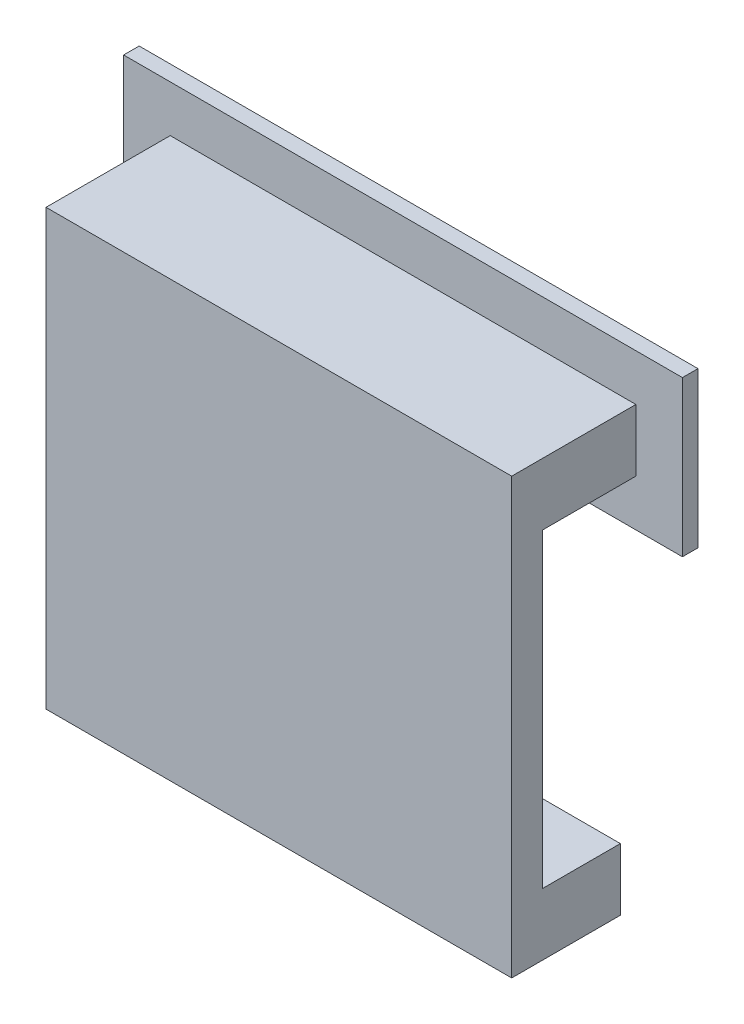
ISO-10303-21;
HEADER;
FILE_DESCRIPTION(('STEP AP214'),'2;1');
FILE_NAME('part.step','',(''),(''),'','','');
FILE_SCHEMA(('AUTOMOTIVE_DESIGN { 1 0 10303 214 1 1 1 1 }'));
ENDSEC;
DATA;
#1=APPLICATION_CONTEXT('core data for automotive mechanical design processes');
#2=APPLICATION_PROTOCOL_DEFINITION('international standard','automotive_design',2000,#1);
#3=PRODUCT_CONTEXT('',#1,'mechanical');
#4=PRODUCT('Part','Part','',(#3));
#5=PRODUCT_RELATED_PRODUCT_CATEGORY('part','',(#4));
#6=PRODUCT_DEFINITION_FORMATION('','',#4);
#7=PRODUCT_DEFINITION_CONTEXT('part definition',#1,'design');
#8=PRODUCT_DEFINITION('design','',#6,#7);
#9=PRODUCT_DEFINITION_SHAPE('','',#8);
#10=(LENGTH_UNIT() NAMED_UNIT(*) SI_UNIT(.MILLI.,.METRE.));
#11=(NAMED_UNIT(*) PLANE_ANGLE_UNIT() SI_UNIT($,.RADIAN.));
#12=(NAMED_UNIT(*) SI_UNIT($,.STERADIAN.) SOLID_ANGLE_UNIT());
#13=UNCERTAINTY_MEASURE_WITH_UNIT(LENGTH_MEASURE(1.E-05),#10,'distance_accuracy_value','');
#14=(GEOMETRIC_REPRESENTATION_CONTEXT(3) GLOBAL_UNCERTAINTY_ASSIGNED_CONTEXT((#13)) GLOBAL_UNIT_ASSIGNED_CONTEXT((#10,
#11,#12)) REPRESENTATION_CONTEXT('',''));
#15=CARTESIAN_POINT('',(0.,0.,0.));
#16=DIRECTION('',(0.,0.,1.));
#17=DIRECTION('',(1.,0.,0.));
#18=AXIS2_PLACEMENT_3D('',#15,#16,#17);
#19=CARTESIAN_POINT('',(0.,0.,0.));
#20=DIRECTION('',(0.,0.,1.));
#21=DIRECTION('',(1.,0.,0.));
#22=AXIS2_PLACEMENT_3D('',#19,#20,#21);
#23=PLANE('',#22);
#24=DIRECTION('',(1.,0.,0.));
#25=VECTOR('',#24,1.);
#26=CARTESIAN_POINT('',(19.05,2.54,0.));
#27=LINE('',#26,#25);
#28=CARTESIAN_POINT('',(-19.05,2.54,0.));
#29=VERTEX_POINT('',#28);
#30=CARTESIAN_POINT('',(19.05,2.54,0.));
#31=VERTEX_POINT('',#30);
#32=EDGE_CURVE('E147',#29,#31,#27,.T.);
#33=ORIENTED_EDGE('',*,*,#32,.F.);
#34=DIRECTION('',(0.,-1.,0.));
#35=VECTOR('',#34,1.);
#36=CARTESIAN_POINT('',(-19.05,2.54,0.));
#37=LINE('',#36,#35);
#38=CARTESIAN_POINT('',(-19.05,27.94,0.));
#39=VERTEX_POINT('',#38);
#40=EDGE_CURVE('E201',#39,#29,#37,.T.);
#41=ORIENTED_EDGE('',*,*,#40,.F.);
#42=DIRECTION('',(-1.,0.,0.));
#43=VECTOR('',#42,1.);
#44=CARTESIAN_POINT('',(19.05,27.94,0.));
#45=LINE('',#44,#43);
#46=CARTESIAN_POINT('',(19.05,27.94,0.));
#47=VERTEX_POINT('',#46);
#48=EDGE_CURVE('E169',#47,#39,#45,.T.);
#49=ORIENTED_EDGE('',*,*,#48,.F.);
#50=DIRECTION('',(0.,1.,0.));
#51=VECTOR('',#50,1.);
#52=CARTESIAN_POINT('',(19.05,2.54,0.));
#53=LINE('',#52,#51);
#54=EDGE_CURVE('E48',#31,#47,#53,.T.);
#55=ORIENTED_EDGE('',*,*,#54,.F.);
#56=EDGE_LOOP('',(#33,#41,#49,#55));
#57=FACE_BOUND('',#56,.T.);
#58=ADVANCED_FACE('F33',(#57),#23,.F.);
#59=CARTESIAN_POINT('',(19.05,2.54,2.54));
#60=DIRECTION('',(-1.,0.,0.));
#61=DIRECTION('',(0.,0.,1.));
#62=AXIS2_PLACEMENT_3D('',#59,#60,#61);
#63=PLANE('',#62);
#64=DIRECTION('',(0.,0.,-1.));
#65=VECTOR('',#64,1.);
#66=CARTESIAN_POINT('',(19.05,-2.54,2.54));
#67=LINE('',#66,#65);
#68=CARTESIAN_POINT('',(19.05,-2.54,2.54));
#69=VERTEX_POINT('',#68);
#70=CARTESIAN_POINT('',(19.05,-2.54,-6.35));
#71=VERTEX_POINT('',#70);
#72=EDGE_CURVE('E41',#69,#71,#67,.T.);
#73=ORIENTED_EDGE('',*,*,#72,.T.);
#74=DIRECTION('',(0.,-1.,0.));
#75=VECTOR('',#74,1.);
#76=CARTESIAN_POINT('',(19.05,2.54,-6.35));
#77=LINE('',#76,#75);
#78=CARTESIAN_POINT('',(19.05,2.54,-6.35));
#79=VERTEX_POINT('',#78);
#80=EDGE_CURVE('E159',#79,#71,#77,.T.);
#81=ORIENTED_EDGE('',*,*,#80,.F.);
#82=DIRECTION('',(0.,0.,1.));
#83=VECTOR('',#82,1.);
#84=CARTESIAN_POINT('',(19.05,2.54,-6.35));
#85=LINE('',#84,#83);
#86=EDGE_CURVE('E164',#79,#31,#85,.T.);
#87=ORIENTED_EDGE('',*,*,#86,.T.);
#88=ORIENTED_EDGE('',*,*,#54,.T.);
#89=DIRECTION('',(0.,0.,1.));
#90=VECTOR('',#89,1.);
#91=CARTESIAN_POINT('',(19.05,27.94,-7.62));
#92=LINE('',#91,#90);
#93=CARTESIAN_POINT('',(19.05,27.94,-7.62));
#94=VERTEX_POINT('',#93);
#95=EDGE_CURVE('E187',#94,#47,#92,.T.);
#96=ORIENTED_EDGE('',*,*,#95,.F.);
#97=DIRECTION('',(0.,-1.,0.));
#98=VECTOR('',#97,1.);
#99=CARTESIAN_POINT('',(19.05,27.94,-7.62));
#100=LINE('',#99,#98);
#101=CARTESIAN_POINT('',(19.05,33.02,-7.62));
#102=VERTEX_POINT('',#101);
#103=EDGE_CURVE('E176',#102,#94,#100,.T.);
#104=ORIENTED_EDGE('',*,*,#103,.F.);
#105=DIRECTION('',(0.,0.,-1.));
#106=VECTOR('',#105,1.);
#107=CARTESIAN_POINT('',(19.05,33.02,0.));
#108=LINE('',#107,#106);
#109=CARTESIAN_POINT('',(19.05,33.02,2.54));
#110=VERTEX_POINT('',#109);
#111=EDGE_CURVE('E190',#110,#102,#108,.T.);
#112=ORIENTED_EDGE('',*,*,#111,.F.);
#113=DIRECTION('',(0.,1.,0.));
#114=VECTOR('',#113,1.);
#115=CARTESIAN_POINT('',(19.05,2.54,2.54));
#116=LINE('',#115,#114);
#117=EDGE_CURVE('E198',#69,#110,#116,.T.);
#118=ORIENTED_EDGE('',*,*,#117,.F.);
#119=EDGE_LOOP('',(#73,#81,#87,#88,#96,#104,#112,#118));
#120=FACE_BOUND('',#119,.T.);
#121=ADVANCED_FACE('F35',(#120),#63,.F.);
#122=CARTESIAN_POINT('',(-19.05,2.54,2.54));
#123=DIRECTION('',(1.,0.,0.));
#124=DIRECTION('',(0.,0.,-1.));
#125=AXIS2_PLACEMENT_3D('',#122,#123,#124);
#126=PLANE('',#125);
#127=DIRECTION('',(0.,0.,1.));
#128=VECTOR('',#127,1.);
#129=CARTESIAN_POINT('',(-19.05,33.02,0.));
#130=LINE('',#129,#128);
#131=CARTESIAN_POINT('',(-19.05,33.02,-7.62));
#132=VERTEX_POINT('',#131);
#133=CARTESIAN_POINT('',(-19.05,33.02,2.54));
#134=VERTEX_POINT('',#133);
#135=EDGE_CURVE('E192',#132,#134,#130,.T.);
#136=ORIENTED_EDGE('',*,*,#135,.F.);
#137=DIRECTION('',(0.,1.,0.));
#138=VECTOR('',#137,1.);
#139=CARTESIAN_POINT('',(-19.05,27.94,-7.62));
#140=LINE('',#139,#138);
#141=CARTESIAN_POINT('',(-19.05,27.94,-7.62));
#142=VERTEX_POINT('',#141);
#143=EDGE_CURVE('E170',#142,#132,#140,.T.);
#144=ORIENTED_EDGE('',*,*,#143,.F.);
#145=DIRECTION('',(0.,0.,1.));
#146=VECTOR('',#145,1.);
#147=CARTESIAN_POINT('',(-19.05,27.94,-7.62));
#148=LINE('',#147,#146);
#149=EDGE_CURVE('E182',#142,#39,#148,.T.);
#150=ORIENTED_EDGE('',*,*,#149,.T.);
#151=ORIENTED_EDGE('',*,*,#40,.T.);
#152=DIRECTION('',(0.,0.,1.));
#153=VECTOR('',#152,1.);
#154=CARTESIAN_POINT('',(-19.05,2.54,-6.35));
#155=LINE('',#154,#153);
#156=CARTESIAN_POINT('',(-19.05,2.54,-6.35));
#157=VERTEX_POINT('',#156);
#158=EDGE_CURVE('E167',#157,#29,#155,.T.);
#159=ORIENTED_EDGE('',*,*,#158,.F.);
#160=DIRECTION('',(0.,1.,0.));
#161=VECTOR('',#160,1.);
#162=CARTESIAN_POINT('',(-19.05,2.54,-6.35));
#163=LINE('',#162,#161);
#164=CARTESIAN_POINT('',(-19.05,-2.54,-6.35));
#165=VERTEX_POINT('',#164);
#166=EDGE_CURVE('E149',#165,#157,#163,.T.);
#167=ORIENTED_EDGE('',*,*,#166,.F.);
#168=DIRECTION('',(0.,0.,-1.));
#169=VECTOR('',#168,1.);
#170=CARTESIAN_POINT('',(-19.05,-2.54,2.54));
#171=LINE('',#170,#169);
#172=CARTESIAN_POINT('',(-19.05,-2.54,2.54));
#173=VERTEX_POINT('',#172);
#174=EDGE_CURVE('E11',#173,#165,#171,.T.);
#175=ORIENTED_EDGE('',*,*,#174,.F.);
#176=DIRECTION('',(0.,-1.,0.));
#177=VECTOR('',#176,1.);
#178=CARTESIAN_POINT('',(-19.05,2.54,2.54));
#179=LINE('',#178,#177);
#180=EDGE_CURVE('E200',#134,#173,#179,.T.);
#181=ORIENTED_EDGE('',*,*,#180,.F.);
#182=EDGE_LOOP('',(#136,#144,#150,#151,#159,#167,#175,#181));
#183=FACE_BOUND('',#182,.T.);
#184=ADVANCED_FACE('F218',(#183),#126,.F.);
#185=CARTESIAN_POINT('',(-19.05,-2.54,2.54));
#186=DIRECTION('',(0.,1.,0.));
#187=DIRECTION('',(0.,0.,1.));
#188=AXIS2_PLACEMENT_3D('',#185,#186,#187);
#189=PLANE('',#188);
#190=ORIENTED_EDGE('',*,*,#174,.T.);
#191=DIRECTION('',(-1.,0.,0.));
#192=VECTOR('',#191,1.);
#193=CARTESIAN_POINT('',(19.05,-2.54,-6.35));
#194=LINE('',#193,#192);
#195=EDGE_CURVE('E162',#71,#165,#194,.T.);
#196=ORIENTED_EDGE('',*,*,#195,.F.);
#197=ORIENTED_EDGE('',*,*,#72,.F.);
#198=DIRECTION('',(1.,0.,0.));
#199=VECTOR('',#198,1.);
#200=CARTESIAN_POINT('',(-19.05,-2.54,2.54));
#201=LINE('',#200,#199);
#202=EDGE_CURVE('E56',#173,#69,#201,.T.);
#203=ORIENTED_EDGE('',*,*,#202,.F.);
#204=EDGE_LOOP('',(#190,#196,#197,#203));
#205=FACE_BOUND('',#204,.T.);
#206=ADVANCED_FACE('F215',(#205),#189,.F.);
#207=CARTESIAN_POINT('',(0.,0.,2.54));
#208=DIRECTION('',(0.,0.,1.));
#209=DIRECTION('',(1.,0.,0.));
#210=AXIS2_PLACEMENT_3D('',#207,#208,#209);
#211=PLANE('',#210);
#212=ORIENTED_EDGE('',*,*,#117,.T.);
#213=DIRECTION('',(1.,0.,0.));
#214=VECTOR('',#213,1.);
#215=CARTESIAN_POINT('',(-19.05,33.02,2.54));
#216=LINE('',#215,#214);
#217=EDGE_CURVE('E195',#134,#110,#216,.T.);
#218=ORIENTED_EDGE('',*,*,#217,.F.);
#219=ORIENTED_EDGE('',*,*,#180,.T.);
#220=ORIENTED_EDGE('',*,*,#202,.T.);
#221=EDGE_LOOP('',(#212,#218,#219,#220));
#222=FACE_BOUND('',#221,.T.);
#223=ADVANCED_FACE('F235',(#222),#211,.T.);
#224=CARTESIAN_POINT('',(0.,33.02,0.));
#225=DIRECTION('',(0.,1.,0.));
#226=DIRECTION('',(0.,0.,1.));
#227=AXIS2_PLACEMENT_3D('',#224,#225,#226);
#228=PLANE('',#227);
#229=ORIENTED_EDGE('',*,*,#111,.T.);
#230=DIRECTION('',(1.,0.,0.));
#231=VECTOR('',#230,1.);
#232=CARTESIAN_POINT('',(19.05,33.02,-7.62));
#233=LINE('',#232,#231);
#234=EDGE_CURVE('E173',#132,#102,#233,.T.);
#235=ORIENTED_EDGE('',*,*,#234,.F.);
#236=ORIENTED_EDGE('',*,*,#135,.T.);
#237=ORIENTED_EDGE('',*,*,#217,.T.);
#238=EDGE_LOOP('',(#229,#235,#236,#237));
#239=FACE_BOUND('',#238,.T.);
#240=ADVANCED_FACE('F233',(#239),#228,.T.);
#241=CARTESIAN_POINT('',(19.05,27.94,-7.62));
#242=DIRECTION('',(0.,1.,0.));
#243=DIRECTION('',(0.,0.,1.));
#244=AXIS2_PLACEMENT_3D('',#241,#242,#243);
#245=PLANE('',#244);
#246=ORIENTED_EDGE('',*,*,#48,.T.);
#247=ORIENTED_EDGE('',*,*,#149,.F.);
#248=DIRECTION('',(-1.,0.,0.));
#249=VECTOR('',#248,1.);
#250=CARTESIAN_POINT('',(19.05,27.94,-7.62));
#251=LINE('',#250,#249);
#252=EDGE_CURVE('E179',#94,#142,#251,.T.);
#253=ORIENTED_EDGE('',*,*,#252,.F.);
#254=ORIENTED_EDGE('',*,*,#95,.T.);
#255=EDGE_LOOP('',(#246,#247,#253,#254));
#256=FACE_BOUND('',#255,.T.);
#257=ADVANCED_FACE('F227',(#256),#245,.F.);
#258=CARTESIAN_POINT('',(19.05,2.54,-6.35));
#259=DIRECTION('',(0.,-1.,0.));
#260=DIRECTION('',(0.,0.,-1.));
#261=AXIS2_PLACEMENT_3D('',#258,#259,#260);
#262=PLANE('',#261);
#263=ORIENTED_EDGE('',*,*,#32,.T.);
#264=ORIENTED_EDGE('',*,*,#86,.F.);
#265=DIRECTION('',(1.,0.,0.));
#266=VECTOR('',#265,1.);
#267=CARTESIAN_POINT('',(19.05,2.54,-6.35));
#268=LINE('',#267,#266);
#269=EDGE_CURVE('E157',#157,#79,#268,.T.);
#270=ORIENTED_EDGE('',*,*,#269,.F.);
#271=ORIENTED_EDGE('',*,*,#158,.T.);
#272=EDGE_LOOP('',(#263,#264,#270,#271));
#273=FACE_BOUND('',#272,.T.);
#274=ADVANCED_FACE('F222',(#273),#262,.F.);
#275=CARTESIAN_POINT('',(0.,0.,-6.35));
#276=DIRECTION('',(0.,0.,-1.));
#277=DIRECTION('',(-1.,0.,0.));
#278=AXIS2_PLACEMENT_3D('',#275,#276,#277);
#279=PLANE('',#278);
#280=ORIENTED_EDGE('',*,*,#166,.T.);
#281=ORIENTED_EDGE('',*,*,#269,.T.);
#282=ORIENTED_EDGE('',*,*,#80,.T.);
#283=ORIENTED_EDGE('',*,*,#195,.T.);
#284=EDGE_LOOP('',(#280,#281,#282,#283));
#285=FACE_BOUND('',#284,.T.);
#286=ADVANCED_FACE('F212',(#285),#279,.T.);
#287=CARTESIAN_POINT('',(0.,0.,-7.62));
#288=DIRECTION('',(0.,0.,-1.));
#289=DIRECTION('',(-1.,0.,0.));
#290=AXIS2_PLACEMENT_3D('',#287,#288,#289);
#291=PLANE('',#290);
#292=DIRECTION('',(0.,1.,0.));
#293=VECTOR('',#292,1.);
#294=CARTESIAN_POINT('',(-22.86,36.83,-7.62));
#295=LINE('',#294,#293);
#296=CARTESIAN_POINT('',(-22.86,24.13,-7.62));
#297=VERTEX_POINT('',#296);
#298=CARTESIAN_POINT('',(-22.86,36.83,-7.62));
#299=VERTEX_POINT('',#298);
#300=EDGE_CURVE('E146',#297,#299,#295,.T.);
#301=ORIENTED_EDGE('',*,*,#300,.F.);
#302=DIRECTION('',(-1.,0.,0.));
#303=VECTOR('',#302,1.);
#304=CARTESIAN_POINT('',(22.86,24.13,-7.62));
#305=LINE('',#304,#303);
#306=CARTESIAN_POINT('',(22.86,24.13,-7.62));
#307=VERTEX_POINT('',#306);
#308=EDGE_CURVE('E142',#307,#297,#305,.T.);
#309=ORIENTED_EDGE('',*,*,#308,.F.);
#310=DIRECTION('',(0.,-1.,0.));
#311=VECTOR('',#310,1.);
#312=CARTESIAN_POINT('',(22.86,36.83,-7.62));
#313=LINE('',#312,#311);
#314=CARTESIAN_POINT('',(22.86,36.83,-7.62));
#315=VERTEX_POINT('',#314);
#316=EDGE_CURVE('E378',#315,#307,#313,.T.);
#317=ORIENTED_EDGE('',*,*,#316,.F.);
#318=DIRECTION('',(1.,0.,0.));
#319=VECTOR('',#318,1.);
#320=CARTESIAN_POINT('',(22.86,36.83,-7.62));
#321=LINE('',#320,#319);
#322=EDGE_CURVE('E381',#299,#315,#321,.T.);
#323=ORIENTED_EDGE('',*,*,#322,.F.);
#324=EDGE_LOOP('',(#301,#309,#317,#323));
#325=FACE_BOUND('',#324,.T.);
#326=ORIENTED_EDGE('',*,*,#252,.T.);
#327=ORIENTED_EDGE('',*,*,#143,.T.);
#328=ORIENTED_EDGE('',*,*,#234,.T.);
#329=ORIENTED_EDGE('',*,*,#103,.T.);
#330=EDGE_LOOP('',(#326,#327,#328,#329));
#331=FACE_BOUND('',#330,.T.);
#332=ADVANCED_FACE('F231',(#325,#331),#291,.F.);
#333=CARTESIAN_POINT('',(-22.86,36.83,-8.89));
#334=DIRECTION('',(1.,0.,0.));
#335=DIRECTION('',(0.,1.,0.));
#336=AXIS2_PLACEMENT_3D('',#333,#334,#335);
#337=PLANE('',#336);
#338=ORIENTED_EDGE('',*,*,#300,.T.);
#339=DIRECTION('',(0.,0.,1.));
#340=VECTOR('',#339,1.);
#341=CARTESIAN_POINT('',(-22.86,36.83,-8.89));
#342=LINE('',#341,#340);
#343=CARTESIAN_POINT('',(-22.86,36.83,-8.89));
#344=VERTEX_POINT('',#343);
#345=EDGE_CURVE('E126',#344,#299,#342,.T.);
#346=ORIENTED_EDGE('',*,*,#345,.F.);
#347=DIRECTION('',(0.,1.,0.));
#348=VECTOR('',#347,1.);
#349=CARTESIAN_POINT('',(-22.86,36.83,-8.89));
#350=LINE('',#349,#348);
#351=CARTESIAN_POINT('',(-22.86,24.13,-8.89));
#352=VERTEX_POINT('',#351);
#353=EDGE_CURVE('E133',#352,#344,#350,.T.);
#354=ORIENTED_EDGE('',*,*,#353,.F.);
#355=DIRECTION('',(0.,0.,1.));
#356=VECTOR('',#355,1.);
#357=CARTESIAN_POINT('',(-22.86,24.13,-8.89));
#358=LINE('',#357,#356);
#359=EDGE_CURVE('E375',#352,#297,#358,.T.);
#360=ORIENTED_EDGE('',*,*,#359,.T.);
#361=EDGE_LOOP('',(#338,#346,#354,#360));
#362=FACE_BOUND('',#361,.T.);
#363=ADVANCED_FACE('F144',(#362),#337,.F.);
#364=CARTESIAN_POINT('',(22.86,36.83,-8.89));
#365=DIRECTION('',(0.,-1.,0.));
#366=DIRECTION('',(0.,0.,-1.));
#367=AXIS2_PLACEMENT_3D('',#364,#365,#366);
#368=PLANE('',#367);
#369=ORIENTED_EDGE('',*,*,#322,.T.);
#370=DIRECTION('',(0.,0.,1.));
#371=VECTOR('',#370,1.);
#372=CARTESIAN_POINT('',(22.86,36.83,-8.89));
#373=LINE('',#372,#371);
#374=CARTESIAN_POINT('',(22.86,36.83,-8.89));
#375=VERTEX_POINT('',#374);
#376=EDGE_CURVE('E129',#375,#315,#373,.T.);
#377=ORIENTED_EDGE('',*,*,#376,.F.);
#378=DIRECTION('',(1.,0.,0.));
#379=VECTOR('',#378,1.);
#380=CARTESIAN_POINT('',(22.86,36.83,-8.89));
#381=LINE('',#380,#379);
#382=EDGE_CURVE('E122',#344,#375,#381,.T.);
#383=ORIENTED_EDGE('',*,*,#382,.F.);
#384=ORIENTED_EDGE('',*,*,#345,.T.);
#385=EDGE_LOOP('',(#369,#377,#383,#384));
#386=FACE_BOUND('',#385,.T.);
#387=ADVANCED_FACE('F124',(#386),#368,.F.);
#388=CARTESIAN_POINT('',(22.86,36.83,-8.89));
#389=DIRECTION('',(-1.,0.,0.));
#390=DIRECTION('',(0.,-1.,0.));
#391=AXIS2_PLACEMENT_3D('',#388,#389,#390);
#392=PLANE('',#391);
#393=ORIENTED_EDGE('',*,*,#316,.T.);
#394=DIRECTION('',(0.,0.,1.));
#395=VECTOR('',#394,1.);
#396=CARTESIAN_POINT('',(22.86,24.13,-8.89));
#397=LINE('',#396,#395);
#398=CARTESIAN_POINT('',(22.86,24.13,-8.89));
#399=VERTEX_POINT('',#398);
#400=EDGE_CURVE('E151',#399,#307,#397,.T.);
#401=ORIENTED_EDGE('',*,*,#400,.F.);
#402=DIRECTION('',(0.,-1.,0.));
#403=VECTOR('',#402,1.);
#404=CARTESIAN_POINT('',(22.86,36.83,-8.89));
#405=LINE('',#404,#403);
#406=EDGE_CURVE('E132',#375,#399,#405,.T.);
#407=ORIENTED_EDGE('',*,*,#406,.F.);
#408=ORIENTED_EDGE('',*,*,#376,.T.);
#409=EDGE_LOOP('',(#393,#401,#407,#408));
#410=FACE_BOUND('',#409,.T.);
#411=ADVANCED_FACE('F342',(#410),#392,.F.);
#412=CARTESIAN_POINT('',(22.86,24.13,-8.89));
#413=DIRECTION('',(0.,1.,0.));
#414=DIRECTION('',(0.,0.,1.));
#415=AXIS2_PLACEMENT_3D('',#412,#413,#414);
#416=PLANE('',#415);
#417=ORIENTED_EDGE('',*,*,#308,.T.);
#418=ORIENTED_EDGE('',*,*,#359,.F.);
#419=DIRECTION('',(-1.,0.,0.));
#420=VECTOR('',#419,1.);
#421=CARTESIAN_POINT('',(22.86,24.13,-8.89));
#422=LINE('',#421,#420);
#423=EDGE_CURVE('E138',#399,#352,#422,.T.);
#424=ORIENTED_EDGE('',*,*,#423,.F.);
#425=ORIENTED_EDGE('',*,*,#400,.T.);
#426=EDGE_LOOP('',(#417,#418,#424,#425));
#427=FACE_BOUND('',#426,.T.);
#428=ADVANCED_FACE('F351',(#427),#416,.F.);
#429=CARTESIAN_POINT('',(0.,0.,-8.89));
#430=DIRECTION('',(0.,0.,-1.));
#431=DIRECTION('',(-1.,0.,0.));
#432=AXIS2_PLACEMENT_3D('',#429,#430,#431);
#433=PLANE('',#432);
#434=ORIENTED_EDGE('',*,*,#353,.T.);
#435=ORIENTED_EDGE('',*,*,#382,.T.);
#436=ORIENTED_EDGE('',*,*,#406,.T.);
#437=ORIENTED_EDGE('',*,*,#423,.T.);
#438=EDGE_LOOP('',(#434,#435,#436,#437));
#439=FACE_BOUND('',#438,.T.);
#440=ADVANCED_FACE('F136',(#439),#433,.T.);
#441=CLOSED_SHELL('',(#58,#121,#184,#206,#223,#240,#257,#274,#286,#332,#363,#387,#411,#428,#440));
#442=MANIFOLD_SOLID_BREP('B2',#441);
#443=ADVANCED_BREP_SHAPE_REPRESENTATION('',(#18,#442),#14);
#444=SHAPE_DEFINITION_REPRESENTATION(#9,#443);
ENDSEC;
END-ISO-10303-21;
